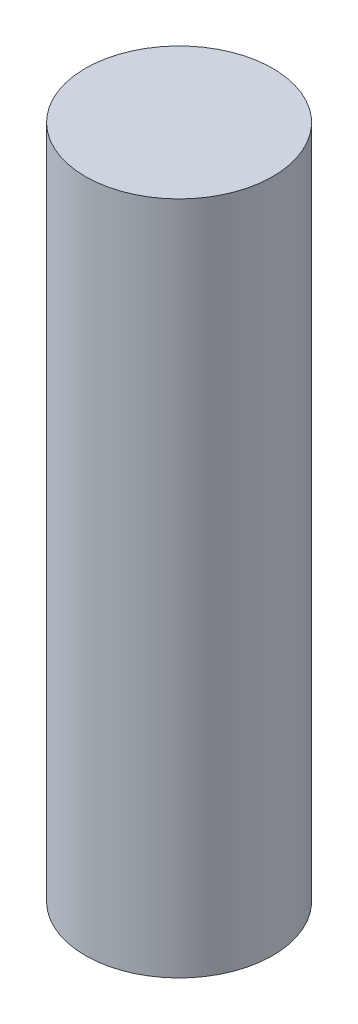
ISO-10303-21;
HEADER;
FILE_DESCRIPTION(('STEP AP214'),'2;1');
FILE_NAME('part.step','',(''),(''),'','','');
FILE_SCHEMA(('AUTOMOTIVE_DESIGN { 1 0 10303 214 1 1 1 1 }'));
ENDSEC;
DATA;
#1=APPLICATION_CONTEXT('core data for automotive mechanical design processes');
#2=APPLICATION_PROTOCOL_DEFINITION('international standard','automotive_design',2000,#1);
#3=PRODUCT_CONTEXT('',#1,'mechanical');
#4=PRODUCT('Part','Part','',(#3));
#5=PRODUCT_RELATED_PRODUCT_CATEGORY('part','',(#4));
#6=PRODUCT_DEFINITION_FORMATION('','',#4);
#7=PRODUCT_DEFINITION_CONTEXT('part definition',#1,'design');
#8=PRODUCT_DEFINITION('design','',#6,#7);
#9=PRODUCT_DEFINITION_SHAPE('','',#8);
#10=(LENGTH_UNIT() NAMED_UNIT(*) SI_UNIT(.MILLI.,.METRE.));
#11=(NAMED_UNIT(*) PLANE_ANGLE_UNIT() SI_UNIT($,.RADIAN.));
#12=(NAMED_UNIT(*) SI_UNIT($,.STERADIAN.) SOLID_ANGLE_UNIT());
#13=UNCERTAINTY_MEASURE_WITH_UNIT(LENGTH_MEASURE(1.E-05),#10,'distance_accuracy_value','');
#14=(GEOMETRIC_REPRESENTATION_CONTEXT(3) GLOBAL_UNCERTAINTY_ASSIGNED_CONTEXT((#13)) GLOBAL_UNIT_ASSIGNED_CONTEXT((#10,
#11,#12)) REPRESENTATION_CONTEXT('',''));
#15=CARTESIAN_POINT('',(0.,0.,0.));
#16=DIRECTION('',(0.,0.,1.));
#17=DIRECTION('',(1.,0.,0.));
#18=AXIS2_PLACEMENT_3D('',#15,#16,#17);
#19=CARTESIAN_POINT('',(0.,18.,0.));
#20=DIRECTION('',(0.,-1.,0.));
#21=DIRECTION('',(0.,0.,-1.));
#22=AXIS2_PLACEMENT_3D('',#19,#20,#21);
#23=CYLINDRICAL_SURFACE('',#22,2.5);
#24=CARTESIAN_POINT('',(0.,18.,0.));
#25=DIRECTION('',(0.,1.,0.));
#26=DIRECTION('',(0.,0.,1.));
#27=AXIS2_PLACEMENT_3D('',#24,#25,#26);
#28=CIRCLE('',#27,2.5);
#29=CARTESIAN_POINT('',(0.,18.,2.5));
#30=VERTEX_POINT('',#29);
#31=EDGE_CURVE('E10',#30,#30,#28,.T.);
#32=ORIENTED_EDGE('',*,*,#31,.F.);
#33=EDGE_LOOP('',(#32));
#34=FACE_BOUND('',#33,.T.);
#35=CARTESIAN_POINT('',(0.,0.,0.));
#36=DIRECTION('',(0.,1.,0.));
#37=DIRECTION('',(0.,0.,1.));
#38=AXIS2_PLACEMENT_3D('',#35,#36,#37);
#39=CIRCLE('',#38,2.5);
#40=CARTESIAN_POINT('',(0.,0.,2.5));
#41=VERTEX_POINT('',#40);
#42=EDGE_CURVE('E37',#41,#41,#39,.T.);
#43=ORIENTED_EDGE('',*,*,#42,.T.);
#44=EDGE_LOOP('',(#43));
#45=FACE_BOUND('',#44,.T.);
#46=ADVANCED_FACE('F34',(#34,#45),#23,.T.);
#47=CARTESIAN_POINT('',(0.,18.,0.));
#48=DIRECTION('',(0.,1.,0.));
#49=DIRECTION('',(0.,0.,1.));
#50=AXIS2_PLACEMENT_3D('',#47,#48,#49);
#51=PLANE('',#50);
#52=ORIENTED_EDGE('',*,*,#31,.T.);
#53=EDGE_LOOP('',(#52));
#54=FACE_BOUND('',#53,.T.);
#55=ADVANCED_FACE('F49',(#54),#51,.T.);
#56=CARTESIAN_POINT('',(0.,0.,0.));
#57=DIRECTION('',(0.,1.,0.));
#58=DIRECTION('',(0.,0.,1.));
#59=AXIS2_PLACEMENT_3D('',#56,#57,#58);
#60=PLANE('',#59);
#61=ORIENTED_EDGE('',*,*,#42,.F.);
#62=EDGE_LOOP('',(#61));
#63=FACE_BOUND('',#62,.T.);
#64=ADVANCED_FACE('F47',(#63),#60,.F.);
#65=CLOSED_SHELL('',(#46,#55,#64));
#66=MANIFOLD_SOLID_BREP('B2',#65);
#67=ADVANCED_BREP_SHAPE_REPRESENTATION('',(#18,#66),#14);
#68=SHAPE_DEFINITION_REPRESENTATION(#9,#67);
ENDSEC;
END-ISO-10303-21;
